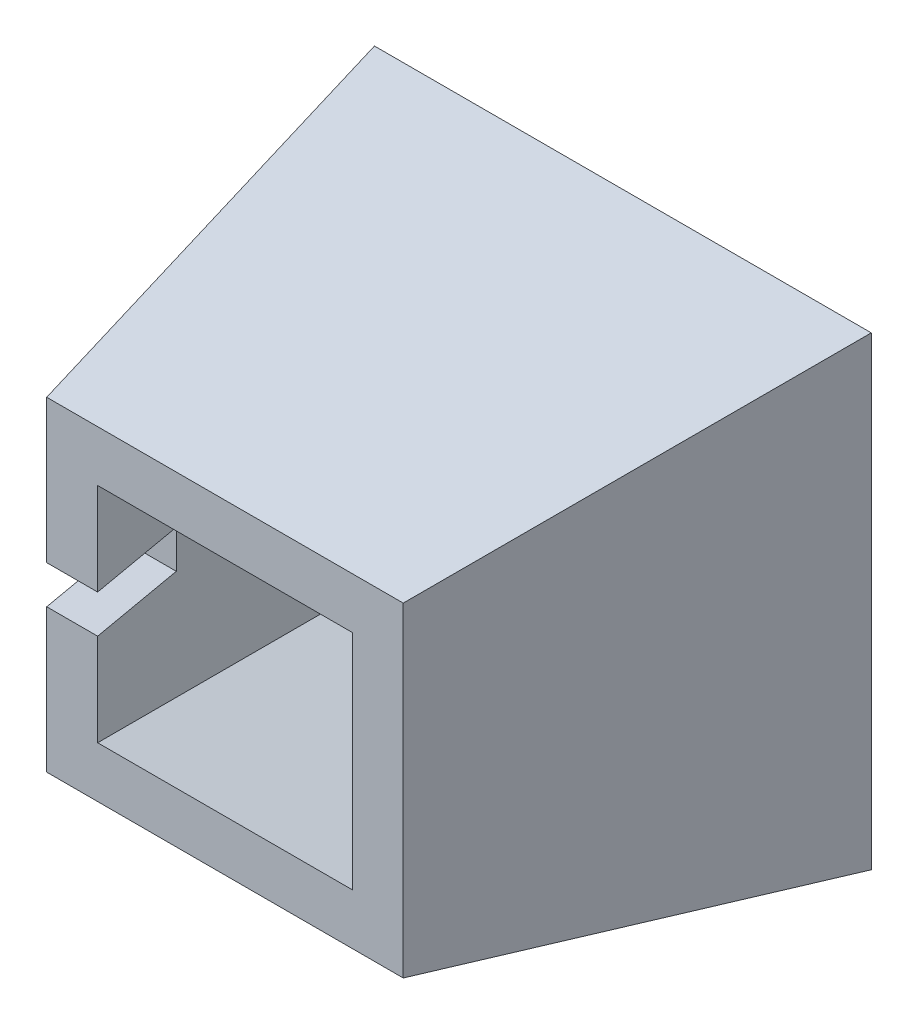
ISO-10303-21;
HEADER;
FILE_DESCRIPTION(('STEP AP214'),'2;1');
FILE_NAME('part.step','',(''),(''),'','','');
FILE_SCHEMA(('AUTOMOTIVE_DESIGN { 1 0 10303 214 1 1 1 1 }'));
ENDSEC;
DATA;
#1=APPLICATION_CONTEXT('core data for automotive mechanical design processes');
#2=APPLICATION_PROTOCOL_DEFINITION('international standard','automotive_design',2000,#1);
#3=PRODUCT_CONTEXT('',#1,'mechanical');
#4=PRODUCT('Part','Part','',(#3));
#5=PRODUCT_RELATED_PRODUCT_CATEGORY('part','',(#4));
#6=PRODUCT_DEFINITION_FORMATION('','',#4);
#7=PRODUCT_DEFINITION_CONTEXT('part definition',#1,'design');
#8=PRODUCT_DEFINITION('design','',#6,#7);
#9=PRODUCT_DEFINITION_SHAPE('','',#8);
#10=(LENGTH_UNIT() NAMED_UNIT(*) SI_UNIT(.MILLI.,.METRE.));
#11=(NAMED_UNIT(*) PLANE_ANGLE_UNIT() SI_UNIT($,.RADIAN.));
#12=(NAMED_UNIT(*) SI_UNIT($,.STERADIAN.) SOLID_ANGLE_UNIT());
#13=UNCERTAINTY_MEASURE_WITH_UNIT(LENGTH_MEASURE(1.E-05),#10,'distance_accuracy_value','');
#14=(GEOMETRIC_REPRESENTATION_CONTEXT(3) GLOBAL_UNCERTAINTY_ASSIGNED_CONTEXT((#13)) GLOBAL_UNIT_ASSIGNED_CONTEXT((#10,
#11,#12)) REPRESENTATION_CONTEXT('',''));
#15=CARTESIAN_POINT('',(0.,0.,0.));
#16=DIRECTION('',(0.,0.,1.));
#17=DIRECTION('',(1.,0.,0.));
#18=AXIS2_PLACEMENT_3D('',#15,#16,#17);
#19=CARTESIAN_POINT('',(0.,0.,-125.));
#20=DIRECTION('',(0.,0.,-1.));
#21=DIRECTION('',(-1.,0.,0.));
#22=AXIS2_PLACEMENT_3D('',#19,#20,#21);
#23=PLANE('',#22);
#24=DIRECTION('',(0.,1.,0.));
#25=VECTOR('',#24,1.);
#26=CARTESIAN_POINT('',(78.0408725885582,-51.,-125.));
#27=LINE('',#26,#25);
#28=CARTESIAN_POINT('',(78.0408725885582,-73.0408725885582,-125.));
#29=VERTEX_POINT('',#28);
#30=CARTESIAN_POINT('',(78.0408725885582,73.0408725885582,-125.));
#31=VERTEX_POINT('',#30);
#32=EDGE_CURVE('E200',#29,#31,#27,.T.);
#33=ORIENTED_EDGE('',*,*,#32,.F.);
#34=DIRECTION('',(1.,0.,0.));
#35=VECTOR('',#34,1.);
#36=CARTESIAN_POINT('',(-56.,-73.0408725885582,-125.));
#37=LINE('',#36,#35);
#38=CARTESIAN_POINT('',(-78.0408725885582,-73.0408725885582,-125.));
#39=VERTEX_POINT('',#38);
#40=EDGE_CURVE('E205',#39,#29,#37,.T.);
#41=ORIENTED_EDGE('',*,*,#40,.F.);
#42=DIRECTION('',(0.,-1.,0.));
#43=VECTOR('',#42,1.);
#44=CARTESIAN_POINT('',(-78.0408725885582,-51.,-125.));
#45=LINE('',#44,#43);
#46=CARTESIAN_POINT('',(-78.0408725885582,73.0408725885582,-125.));
#47=VERTEX_POINT('',#46);
#48=EDGE_CURVE('E212',#47,#39,#45,.T.);
#49=ORIENTED_EDGE('',*,*,#48,.F.);
#50=DIRECTION('',(-1.,0.,0.));
#51=VECTOR('',#50,1.);
#52=CARTESIAN_POINT('',(-56.,73.0408725885582,-125.));
#53=LINE('',#52,#51);
#54=EDGE_CURVE('E37',#31,#47,#53,.T.);
#55=ORIENTED_EDGE('',*,*,#54,.F.);
#56=EDGE_LOOP('',(#33,#41,#49,#55));
#57=FACE_BOUND('',#56,.T.);
#58=DIRECTION('',(-1.,0.,0.));
#59=VECTOR('',#58,1.);
#60=CARTESIAN_POINT('',(40.,57.0408725885582,-125.));
#61=LINE('',#60,#59);
#62=CARTESIAN_POINT('',(-62.0408725885582,57.0408725885582,-125.));
#63=VERTEX_POINT('',#62);
#64=CARTESIAN_POINT('',(62.0408725885582,57.0408725885582,-125.));
#65=VERTEX_POINT('',#64);
#66=EDGE_CURVE('E157',#63,#65,#61,.F.);
#67=ORIENTED_EDGE('',*,*,#66,.F.);
#68=DIRECTION('',(0.,-1.,0.));
#69=VECTOR('',#68,1.);
#70=CARTESIAN_POINT('',(-62.0408725885582,-35.,-125.));
#71=LINE('',#70,#69);
#72=CARTESIAN_POINT('',(-62.0408725885582,-57.0408725885582,-125.));
#73=VERTEX_POINT('',#72);
#74=EDGE_CURVE('E160',#73,#63,#71,.F.);
#75=ORIENTED_EDGE('',*,*,#74,.F.);
#76=DIRECTION('',(1.,0.,0.));
#77=VECTOR('',#76,1.);
#78=CARTESIAN_POINT('',(40.,-57.0408725885582,-125.));
#79=LINE('',#78,#77);
#80=CARTESIAN_POINT('',(62.0408725885582,-57.0408725885582,-125.));
#81=VERTEX_POINT('',#80);
#82=EDGE_CURVE('E179',#81,#73,#79,.F.);
#83=ORIENTED_EDGE('',*,*,#82,.F.);
#84=DIRECTION('',(0.,1.,0.));
#85=VECTOR('',#84,1.);
#86=CARTESIAN_POINT('',(62.0408725885582,-35.,-125.));
#87=LINE('',#86,#85);
#88=EDGE_CURVE('E58',#65,#81,#87,.F.);
#89=ORIENTED_EDGE('',*,*,#88,.F.);
#90=EDGE_LOOP('',(#67,#75,#83,#89));
#91=FACE_BOUND('',#90,.T.);
#92=ADVANCED_FACE('F33',(#57,#91),#23,.T.);
#93=CARTESIAN_POINT('',(0.,0.,0.));
#94=DIRECTION('',(0.,0.,-1.));
#95=DIRECTION('',(-1.,0.,0.));
#96=AXIS2_PLACEMENT_3D('',#93,#94,#95);
#97=PLANE('',#96);
#98=DIRECTION('',(0.,-1.,0.));
#99=VECTOR('',#98,1.);
#100=CARTESIAN_POINT('',(-56.,-51.,0.));
#101=LINE('',#100,#99);
#102=CARTESIAN_POINT('',(-56.,51.,0.));
#103=VERTEX_POINT('',#102);
#104=CARTESIAN_POINT('',(-56.,6.,0.));
#105=VERTEX_POINT('',#104);
#106=EDGE_CURVE('E195',#103,#105,#101,.T.);
#107=ORIENTED_EDGE('',*,*,#106,.T.);
#108=DIRECTION('',(-1.,0.,0.));
#109=VECTOR('',#108,1.);
#110=CARTESIAN_POINT('',(78.0418725885582,6.,0.));
#111=LINE('',#110,#109);
#112=CARTESIAN_POINT('',(-40.,6.,0.));
#113=VERTEX_POINT('',#112);
#114=EDGE_CURVE('E140',#113,#105,#111,.T.);
#115=ORIENTED_EDGE('',*,*,#114,.F.);
#116=DIRECTION('',(0.,1.,0.));
#117=VECTOR('',#116,1.);
#118=CARTESIAN_POINT('',(-40.,-35.,0.));
#119=LINE('',#118,#117);
#120=CARTESIAN_POINT('',(-40.,35.,0.));
#121=VERTEX_POINT('',#120);
#122=EDGE_CURVE('E163',#113,#121,#119,.T.);
#123=ORIENTED_EDGE('',*,*,#122,.T.);
#124=DIRECTION('',(1.,0.,0.));
#125=VECTOR('',#124,1.);
#126=CARTESIAN_POINT('',(40.,35.,0.));
#127=LINE('',#126,#125);
#128=CARTESIAN_POINT('',(40.,35.,0.));
#129=VERTEX_POINT('',#128);
#130=EDGE_CURVE('E166',#121,#129,#127,.T.);
#131=ORIENTED_EDGE('',*,*,#130,.T.);
#132=DIRECTION('',(0.,-1.,0.));
#133=VECTOR('',#132,1.);
#134=CARTESIAN_POINT('',(40.,-35.,0.));
#135=LINE('',#134,#133);
#136=CARTESIAN_POINT('',(40.,-35.,0.));
#137=VERTEX_POINT('',#136);
#138=EDGE_CURVE('E169',#129,#137,#135,.T.);
#139=ORIENTED_EDGE('',*,*,#138,.T.);
#140=DIRECTION('',(-1.,0.,0.));
#141=VECTOR('',#140,1.);
#142=CARTESIAN_POINT('',(40.,-35.,0.));
#143=LINE('',#142,#141);
#144=CARTESIAN_POINT('',(-40.,-35.,0.));
#145=VERTEX_POINT('',#144);
#146=EDGE_CURVE('E172',#137,#145,#143,.T.);
#147=ORIENTED_EDGE('',*,*,#146,.T.);
#148=CARTESIAN_POINT('',(-40.,-6.,0.));
#149=VERTEX_POINT('',#148);
#150=EDGE_CURVE('E164',#145,#149,#119,.T.);
#151=ORIENTED_EDGE('',*,*,#150,.T.);
#152=DIRECTION('',(-1.,0.,0.));
#153=VECTOR('',#152,1.);
#154=CARTESIAN_POINT('',(78.0418725885582,-6.,0.));
#155=LINE('',#154,#153);
#156=CARTESIAN_POINT('',(-56.,-6.,0.));
#157=VERTEX_POINT('',#156);
#158=EDGE_CURVE('E50',#149,#157,#155,.T.);
#159=ORIENTED_EDGE('',*,*,#158,.T.);
#160=CARTESIAN_POINT('',(-56.,-51.,0.));
#161=VERTEX_POINT('',#160);
#162=EDGE_CURVE('E194',#157,#161,#101,.T.);
#163=ORIENTED_EDGE('',*,*,#162,.T.);
#164=DIRECTION('',(1.,0.,0.));
#165=VECTOR('',#164,1.);
#166=CARTESIAN_POINT('',(-56.,-51.,0.));
#167=LINE('',#166,#165);
#168=CARTESIAN_POINT('',(56.,-51.,0.));
#169=VERTEX_POINT('',#168);
#170=EDGE_CURVE('E198',#161,#169,#167,.T.);
#171=ORIENTED_EDGE('',*,*,#170,.T.);
#172=DIRECTION('',(0.,1.,0.));
#173=VECTOR('',#172,1.);
#174=CARTESIAN_POINT('',(56.,-51.,0.));
#175=LINE('',#174,#173);
#176=CARTESIAN_POINT('',(56.,51.,0.));
#177=VERTEX_POINT('',#176);
#178=EDGE_CURVE('E188',#169,#177,#175,.T.);
#179=ORIENTED_EDGE('',*,*,#178,.T.);
#180=DIRECTION('',(-1.,0.,0.));
#181=VECTOR('',#180,1.);
#182=CARTESIAN_POINT('',(-56.,51.,0.));
#183=LINE('',#182,#181);
#184=EDGE_CURVE('E191',#177,#103,#183,.T.);
#185=ORIENTED_EDGE('',*,*,#184,.T.);
#186=EDGE_LOOP('',(#107,#115,#123,#131,#139,#147,#151,#159,#163,#171,#179,#185));
#187=FACE_BOUND('',#186,.T.);
#188=ADVANCED_FACE('F234',(#187),#97,.F.);
#189=CARTESIAN_POINT('',(56.,-51.,0.));
#190=DIRECTION('',(0.984807753012208,0.,0.173648177666931));
#191=DIRECTION('',(0.173648177666931,0.,-0.984807753012208));
#192=AXIS2_PLACEMENT_3D('',#189,#190,#191);
#193=PLANE('',#192);
#194=ORIENTED_EDGE('',*,*,#178,.F.);
#195=DIRECTION('',(-0.171087869746036,0.171087869746036,0.970287525247814));
#196=VECTOR('',#195,1.);
#197=CARTESIAN_POINT('',(52.7216413724855,-47.7216413724855,18.5924956824098));
#198=LINE('',#197,#196);
#199=EDGE_CURVE('E11',#29,#169,#198,.T.);
#200=ORIENTED_EDGE('',*,*,#199,.F.);
#201=ORIENTED_EDGE('',*,*,#32,.T.);
#202=DIRECTION('',(-0.171087869746036,-0.171087869746036,0.970287525247814));
#203=VECTOR('',#202,1.);
#204=CARTESIAN_POINT('',(53.0143519642279,48.0143519642279,16.9324514250517));
#205=LINE('',#204,#203);
#206=EDGE_CURVE('E202',#31,#177,#205,.T.);
#207=ORIENTED_EDGE('',*,*,#206,.T.);
#208=EDGE_LOOP('',(#194,#200,#201,#207));
#209=FACE_BOUND('',#208,.T.);
#210=ADVANCED_FACE('F228',(#209),#193,.T.);
#211=CARTESIAN_POINT('',(-56.,-51.,0.));
#212=DIRECTION('',(0.,-0.984807753012208,0.173648177666931));
#213=DIRECTION('',(0.,-0.173648177666931,-0.984807753012208));
#214=AXIS2_PLACEMENT_3D('',#211,#212,#213);
#215=PLANE('',#214);
#216=ORIENTED_EDGE('',*,*,#170,.F.);
#217=DIRECTION('',(0.171087869746036,0.171087869746036,0.970287525247814));
#218=VECTOR('',#217,1.);
#219=CARTESIAN_POINT('',(-56.,-51.,0.));
#220=LINE('',#219,#218);
#221=EDGE_CURVE('E42',#39,#161,#220,.T.);
#222=ORIENTED_EDGE('',*,*,#221,.F.);
#223=ORIENTED_EDGE('',*,*,#40,.T.);
#224=ORIENTED_EDGE('',*,*,#199,.T.);
#225=EDGE_LOOP('',(#216,#222,#223,#224));
#226=FACE_BOUND('',#225,.T.);
#227=ADVANCED_FACE('F35',(#226),#215,.T.);
#228=CARTESIAN_POINT('',(-56.,-51.,0.));
#229=DIRECTION('',(-0.984807753012208,0.,0.173648177666931));
#230=DIRECTION('',(0.173648177666931,0.,0.984807753012208));
#231=AXIS2_PLACEMENT_3D('',#228,#229,#230);
#232=PLANE('',#231);
#233=DIRECTION('',(-0.173648177666931,0.,-0.984807753012208));
#234=VECTOR('',#233,1.);
#235=CARTESIAN_POINT('',(-56.,6.,0.));
#236=LINE('',#235,#234);
#237=CARTESIAN_POINT('',(-61.2898094212539,6.,-30.));
#238=VERTEX_POINT('',#237);
#239=EDGE_CURVE('E154',#105,#238,#236,.T.);
#240=ORIENTED_EDGE('',*,*,#239,.F.);
#241=ORIENTED_EDGE('',*,*,#106,.F.);
#242=DIRECTION('',(0.171087869746036,-0.171087869746036,0.970287525247814));
#243=VECTOR('',#242,1.);
#244=CARTESIAN_POINT('',(-56.,51.,0.));
#245=LINE('',#244,#243);
#246=EDGE_CURVE('E204',#47,#103,#245,.T.);
#247=ORIENTED_EDGE('',*,*,#246,.F.);
#248=ORIENTED_EDGE('',*,*,#48,.T.);
#249=ORIENTED_EDGE('',*,*,#221,.T.);
#250=ORIENTED_EDGE('',*,*,#162,.F.);
#251=DIRECTION('',(0.173648177666931,0.,0.984807753012208));
#252=VECTOR('',#251,1.);
#253=CARTESIAN_POINT('',(-56.,-6.,0.));
#254=LINE('',#253,#252);
#255=CARTESIAN_POINT('',(-61.2898094212539,-6.,-30.));
#256=VERTEX_POINT('',#255);
#257=EDGE_CURVE('E150',#256,#157,#254,.T.);
#258=ORIENTED_EDGE('',*,*,#257,.F.);
#259=DIRECTION('',(0.,-1.,0.));
#260=VECTOR('',#259,1.);
#261=CARTESIAN_POINT('',(-61.2898094212539,-51.,-30.));
#262=LINE('',#261,#260);
#263=EDGE_CURVE('E131',#238,#256,#262,.T.);
#264=ORIENTED_EDGE('',*,*,#263,.F.);
#265=EDGE_LOOP('',(#240,#241,#247,#248,#249,#250,#258,#264));
#266=FACE_BOUND('',#265,.T.);
#267=ADVANCED_FACE('F232',(#266),#232,.T.);
#268=CARTESIAN_POINT('',(-56.,51.,0.));
#269=DIRECTION('',(0.,0.984807753012208,0.173648177666931));
#270=DIRECTION('',(0.,-0.173648177666931,0.984807753012208));
#271=AXIS2_PLACEMENT_3D('',#268,#269,#270);
#272=PLANE('',#271);
#273=ORIENTED_EDGE('',*,*,#184,.F.);
#274=ORIENTED_EDGE('',*,*,#206,.F.);
#275=ORIENTED_EDGE('',*,*,#54,.T.);
#276=ORIENTED_EDGE('',*,*,#246,.T.);
#277=EDGE_LOOP('',(#273,#274,#275,#276));
#278=FACE_BOUND('',#277,.T.);
#279=ADVANCED_FACE('F221',(#278),#272,.T.);
#280=CARTESIAN_POINT('',(-40.,-35.,0.));
#281=DIRECTION('',(-0.984807753012208,0.,0.173648177666931));
#282=DIRECTION('',(0.173648177666931,0.,0.984807753012208));
#283=AXIS2_PLACEMENT_3D('',#280,#281,#282);
#284=PLANE('',#283);
#285=DIRECTION('',(-0.173648177666931,0.,-0.984807753012208));
#286=VECTOR('',#285,1.);
#287=CARTESIAN_POINT('',(-36.4406020133302,6.,20.1863490905845));
#288=LINE('',#287,#286);
#289=CARTESIAN_POINT('',(-45.289809421254,6.,-30.));
#290=VERTEX_POINT('',#289);
#291=EDGE_CURVE('E134',#290,#113,#288,.F.);
#292=ORIENTED_EDGE('',*,*,#291,.F.);
#293=DIRECTION('',(0.,-1.,0.));
#294=VECTOR('',#293,1.);
#295=CARTESIAN_POINT('',(-45.289809421254,-6.,-30.));
#296=LINE('',#295,#294);
#297=CARTESIAN_POINT('',(-45.289809421254,-6.,-30.));
#298=VERTEX_POINT('',#297);
#299=EDGE_CURVE('E128',#298,#290,#296,.F.);
#300=ORIENTED_EDGE('',*,*,#299,.F.);
#301=DIRECTION('',(0.173648177666931,0.,0.984807753012208));
#302=VECTOR('',#301,1.);
#303=CARTESIAN_POINT('',(-36.4406020133302,-6.,20.1863490905845));
#304=LINE('',#303,#302);
#305=EDGE_CURVE('E136',#149,#298,#304,.F.);
#306=ORIENTED_EDGE('',*,*,#305,.F.);
#307=ORIENTED_EDGE('',*,*,#150,.F.);
#308=DIRECTION('',(0.171087869746036,0.171087869746036,0.970287525247814));
#309=VECTOR('',#308,1.);
#310=CARTESIAN_POINT('',(-40.,-35.,0.));
#311=LINE('',#310,#309);
#312=EDGE_CURVE('E175',#73,#145,#311,.T.);
#313=ORIENTED_EDGE('',*,*,#312,.F.);
#314=ORIENTED_EDGE('',*,*,#74,.T.);
#315=DIRECTION('',(0.171087869746036,-0.171087869746036,0.970287525247814));
#316=VECTOR('',#315,1.);
#317=CARTESIAN_POINT('',(-37.6583152660611,32.6583152660611,13.2803540588641));
#318=LINE('',#317,#316);
#319=EDGE_CURVE('E176',#63,#121,#318,.T.);
#320=ORIENTED_EDGE('',*,*,#319,.T.);
#321=ORIENTED_EDGE('',*,*,#122,.F.);
#322=EDGE_LOOP('',(#292,#300,#306,#307,#313,#314,#320,#321));
#323=FACE_BOUND('',#322,.T.);
#324=ADVANCED_FACE('F142',(#323),#284,.F.);
#325=CARTESIAN_POINT('',(40.,35.,0.));
#326=DIRECTION('',(0.,0.984807753012208,0.173648177666931));
#327=DIRECTION('',(0.,-0.173648177666931,0.984807753012208));
#328=AXIS2_PLACEMENT_3D('',#325,#326,#327);
#329=PLANE('',#328);
#330=ORIENTED_EDGE('',*,*,#66,.T.);
#331=DIRECTION('',(-0.171087869746036,-0.171087869746036,0.970287525247814));
#332=VECTOR('',#331,1.);
#333=CARTESIAN_POINT('',(37.9510258578034,32.9510258578035,11.6203098015061));
#334=LINE('',#333,#332);
#335=EDGE_CURVE('E180',#65,#129,#334,.T.);
#336=ORIENTED_EDGE('',*,*,#335,.T.);
#337=ORIENTED_EDGE('',*,*,#130,.F.);
#338=ORIENTED_EDGE('',*,*,#319,.F.);
#339=EDGE_LOOP('',(#330,#336,#337,#338));
#340=FACE_BOUND('',#339,.T.);
#341=ADVANCED_FACE('F243',(#340),#329,.F.);
#342=CARTESIAN_POINT('',(40.,-35.,0.));
#343=DIRECTION('',(0.984807753012208,0.,0.173648177666931));
#344=DIRECTION('',(0.173648177666931,0.,-0.984807753012208));
#345=AXIS2_PLACEMENT_3D('',#342,#343,#344);
#346=PLANE('',#345);
#347=ORIENTED_EDGE('',*,*,#88,.T.);
#348=DIRECTION('',(-0.171087869746036,0.171087869746036,0.970287525247814));
#349=VECTOR('',#348,1.);
#350=CARTESIAN_POINT('',(40.,-35.,0.));
#351=LINE('',#350,#349);
#352=EDGE_CURVE('E183',#81,#137,#351,.T.);
#353=ORIENTED_EDGE('',*,*,#352,.T.);
#354=ORIENTED_EDGE('',*,*,#138,.F.);
#355=ORIENTED_EDGE('',*,*,#335,.F.);
#356=EDGE_LOOP('',(#347,#353,#354,#355));
#357=FACE_BOUND('',#356,.T.);
#358=ADVANCED_FACE('F255',(#357),#346,.F.);
#359=CARTESIAN_POINT('',(40.,-35.,0.));
#360=DIRECTION('',(0.,-0.984807753012208,0.173648177666931));
#361=DIRECTION('',(0.,-0.173648177666931,-0.984807753012208));
#362=AXIS2_PLACEMENT_3D('',#359,#360,#361);
#363=PLANE('',#362);
#364=ORIENTED_EDGE('',*,*,#82,.T.);
#365=ORIENTED_EDGE('',*,*,#312,.T.);
#366=ORIENTED_EDGE('',*,*,#146,.F.);
#367=ORIENTED_EDGE('',*,*,#352,.F.);
#368=EDGE_LOOP('',(#364,#365,#366,#367));
#369=FACE_BOUND('',#368,.T.);
#370=ADVANCED_FACE('F237',(#369),#363,.F.);
#371=CARTESIAN_POINT('',(-70.,6.,0.));
#372=DIRECTION('',(0.,1.,0.));
#373=DIRECTION('',(0.,0.,1.));
#374=AXIS2_PLACEMENT_3D('',#371,#372,#373);
#375=PLANE('',#374);
#376=ORIENTED_EDGE('',*,*,#239,.T.);
#377=DIRECTION('',(1.,0.,0.));
#378=VECTOR('',#377,1.);
#379=CARTESIAN_POINT('',(-70.,6.,-30.));
#380=LINE('',#379,#378);
#381=EDGE_CURVE('E133',#238,#290,#380,.T.);
#382=ORIENTED_EDGE('',*,*,#381,.T.);
#383=ORIENTED_EDGE('',*,*,#291,.T.);
#384=ORIENTED_EDGE('',*,*,#114,.T.);
#385=EDGE_LOOP('',(#376,#382,#383,#384));
#386=FACE_BOUND('',#385,.T.);
#387=ADVANCED_FACE('F247',(#386),#375,.F.);
#388=CARTESIAN_POINT('',(-70.,-6.,-30.));
#389=DIRECTION('',(0.,0.,-1.));
#390=DIRECTION('',(-1.,0.,0.));
#391=AXIS2_PLACEMENT_3D('',#388,#389,#390);
#392=PLANE('',#391);
#393=ORIENTED_EDGE('',*,*,#263,.T.);
#394=DIRECTION('',(1.,0.,0.));
#395=VECTOR('',#394,1.);
#396=CARTESIAN_POINT('',(-70.,-6.,-30.));
#397=LINE('',#396,#395);
#398=EDGE_CURVE('E124',#256,#298,#397,.T.);
#399=ORIENTED_EDGE('',*,*,#398,.T.);
#400=ORIENTED_EDGE('',*,*,#299,.T.);
#401=ORIENTED_EDGE('',*,*,#381,.F.);
#402=EDGE_LOOP('',(#393,#399,#400,#401));
#403=FACE_BOUND('',#402,.T.);
#404=ADVANCED_FACE('F125',(#403),#392,.F.);
#405=CARTESIAN_POINT('',(-70.,-6.,0.));
#406=DIRECTION('',(0.,-1.,0.));
#407=DIRECTION('',(0.,0.,-1.));
#408=AXIS2_PLACEMENT_3D('',#405,#406,#407);
#409=PLANE('',#408);
#410=ORIENTED_EDGE('',*,*,#257,.T.);
#411=ORIENTED_EDGE('',*,*,#158,.F.);
#412=ORIENTED_EDGE('',*,*,#305,.T.);
#413=ORIENTED_EDGE('',*,*,#398,.F.);
#414=EDGE_LOOP('',(#410,#411,#412,#413));
#415=FACE_BOUND('',#414,.T.);
#416=ADVANCED_FACE('F137',(#415),#409,.F.);
#417=CLOSED_SHELL('',(#92,#188,#210,#227,#267,#279,#324,#341,#358,#370,#387,#404,#416));
#418=MANIFOLD_SOLID_BREP('B2',#417);
#419=ADVANCED_BREP_SHAPE_REPRESENTATION('',(#18,#418),#14);
#420=SHAPE_DEFINITION_REPRESENTATION(#9,#419);
ENDSEC;
END-ISO-10303-21;
